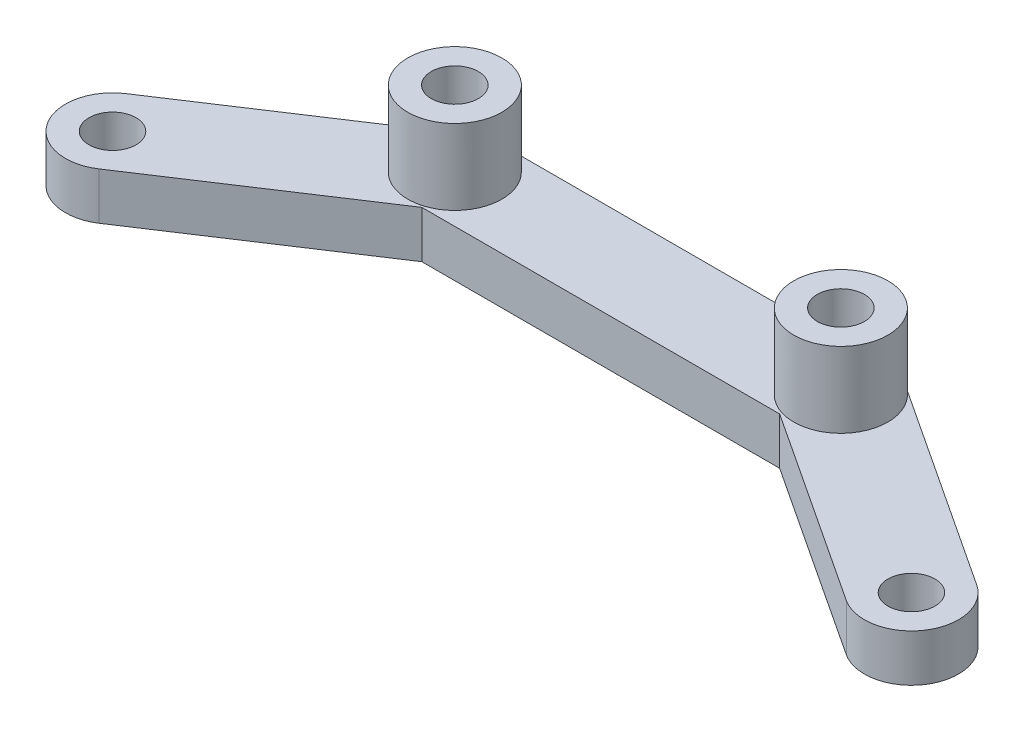
ISO-10303-21;
HEADER;
FILE_DESCRIPTION(('STEP AP214'),'2;1');
FILE_NAME('part.step','',(''),(''),'','','');
FILE_SCHEMA(('AUTOMOTIVE_DESIGN { 1 0 10303 214 1 1 1 1 }'));
ENDSEC;
DATA;
#1=APPLICATION_CONTEXT('core data for automotive mechanical design processes');
#2=APPLICATION_PROTOCOL_DEFINITION('international standard','automotive_design',2000,#1);
#3=PRODUCT_CONTEXT('',#1,'mechanical');
#4=PRODUCT('Part','Part','',(#3));
#5=PRODUCT_RELATED_PRODUCT_CATEGORY('part','',(#4));
#6=PRODUCT_DEFINITION_FORMATION('','',#4);
#7=PRODUCT_DEFINITION_CONTEXT('part definition',#1,'design');
#8=PRODUCT_DEFINITION('design','',#6,#7);
#9=PRODUCT_DEFINITION_SHAPE('','',#8);
#10=(LENGTH_UNIT() NAMED_UNIT(*) SI_UNIT(.MILLI.,.METRE.));
#11=(NAMED_UNIT(*) PLANE_ANGLE_UNIT() SI_UNIT($,.RADIAN.));
#12=(NAMED_UNIT(*) SI_UNIT($,.STERADIAN.) SOLID_ANGLE_UNIT());
#13=UNCERTAINTY_MEASURE_WITH_UNIT(LENGTH_MEASURE(1.E-05),#10,'distance_accuracy_value','');
#14=(GEOMETRIC_REPRESENTATION_CONTEXT(3) GLOBAL_UNCERTAINTY_ASSIGNED_CONTEXT((#13)) GLOBAL_UNIT_ASSIGNED_CONTEXT((#10,
#11,#12)) REPRESENTATION_CONTEXT('',''));
#15=CARTESIAN_POINT('',(0.,0.,0.));
#16=DIRECTION('',(0.,0.,1.));
#17=DIRECTION('',(1.,0.,0.));
#18=AXIS2_PLACEMENT_3D('',#15,#16,#17);
#19=CARTESIAN_POINT('',(-42.4264068711928,5.,42.4264068711929));
#20=DIRECTION('',(0.,-1.,0.));
#21=DIRECTION('',(0.,0.,-1.));
#22=AXIS2_PLACEMENT_3D('',#19,#20,#21);
#23=PLANE('',#22);
#24=CARTESIAN_POINT('',(42.4264068711929,5.,42.4264068711929));
#25=DIRECTION('',(0.,1.,0.));
#26=DIRECTION('',(0.,0.,1.));
#27=AXIS2_PLACEMENT_3D('',#24,#25,#26);
#28=CIRCLE('',#27,2.5);
#29=CARTESIAN_POINT('',(42.4264068711929,5.,44.9264068711929));
#30=VERTEX_POINT('',#29);
#31=EDGE_CURVE('E307',#30,#30,#28,.T.);
#32=ORIENTED_EDGE('',*,*,#31,.F.);
#33=EDGE_LOOP('',(#32));
#34=FACE_BOUND('',#33,.T.);
#35=CARTESIAN_POINT('',(-42.4264068711928,5.,42.4264068711929));
#36=DIRECTION('',(0.,1.,0.));
#37=DIRECTION('',(0.,0.,1.));
#38=AXIS2_PLACEMENT_3D('',#35,#36,#37);
#39=CIRCLE('',#38,2.5);
#40=CARTESIAN_POINT('',(-42.4264068711928,5.,44.9264068711929));
#41=VERTEX_POINT('',#40);
#42=EDGE_CURVE('E273',#41,#41,#39,.T.);
#43=ORIENTED_EDGE('',*,*,#42,.F.);
#44=EDGE_LOOP('',(#43));
#45=FACE_BOUND('',#44,.T.);
#46=CARTESIAN_POINT('',(20.5,5.,28.));
#47=DIRECTION('',(0.,1.,0.));
#48=DIRECTION('',(0.,0.,1.));
#49=AXIS2_PLACEMENT_3D('',#46,#47,#48);
#50=CIRCLE('',#49,5.);
#51=CARTESIAN_POINT('',(20.5,5.,23.));
#52=VERTEX_POINT('',#51);
#53=CARTESIAN_POINT('',(23.2482339660976,5.,23.823014236607));
#54=VERTEX_POINT('',#53);
#55=EDGE_CURVE('E127',#52,#54,#50,.T.);
#56=ORIENTED_EDGE('',*,*,#55,.F.);
#57=DIRECTION('',(-1.,0.,0.));
#58=VECTOR('',#57,1.);
#59=CARTESIAN_POINT('',(-21.9973511112223,5.,23.));
#60=LINE('',#59,#58);
#61=CARTESIAN_POINT('',(-20.5,5.,23.));
#62=VERTEX_POINT('',#61);
#63=EDGE_CURVE('E113',#52,#62,#60,.T.);
#64=ORIENTED_EDGE('',*,*,#63,.T.);
#65=CARTESIAN_POINT('',(-20.5,5.,28.));
#66=DIRECTION('',(0.,1.,0.));
#67=DIRECTION('',(0.,0.,1.));
#68=AXIS2_PLACEMENT_3D('',#65,#66,#67);
#69=CIRCLE('',#68,5.);
#70=CARTESIAN_POINT('',(-23.2482339660976,5.,23.823014236607));
#71=VERTEX_POINT('',#70);
#72=EDGE_CURVE('E142',#71,#62,#69,.T.);
#73=ORIENTED_EDGE('',*,*,#72,.F.);
#74=DIRECTION('',(-0.835397152678596,0.,0.549646793219513));
#75=VECTOR('',#74,1.);
#76=CARTESIAN_POINT('',(-45.1746408372904,5.,38.2494211077999));
#77=LINE('',#76,#75);
#78=CARTESIAN_POINT('',(-45.1746408372904,5.,38.2494211077999));
#79=VERTEX_POINT('',#78);
#80=EDGE_CURVE('E122',#71,#79,#77,.T.);
#81=ORIENTED_EDGE('',*,*,#80,.T.);
#82=CARTESIAN_POINT('',(-42.4264068711928,5.,42.4264068711929));
#83=DIRECTION('',(0.,1.,0.));
#84=DIRECTION('',(0.,0.,-1.));
#85=AXIS2_PLACEMENT_3D('',#82,#83,#84);
#86=CIRCLE('',#85,5.);
#87=CARTESIAN_POINT('',(-39.6781729050953,5.,46.6033926345858));
#88=VERTEX_POINT('',#87);
#89=EDGE_CURVE('E163',#79,#88,#86,.T.);
#90=ORIENTED_EDGE('',*,*,#89,.T.);
#91=DIRECTION('',(0.835397152678596,0.,-0.549646793219513));
#92=VECTOR('',#91,1.);
#93=CARTESIAN_POINT('',(-39.6781729050953,5.,46.6033926345858));
#94=LINE('',#93,#92);
#95=CARTESIAN_POINT('',(-19.0026488887777,5.,33.));
#96=VERTEX_POINT('',#95);
#97=EDGE_CURVE('E295',#88,#96,#94,.T.);
#98=ORIENTED_EDGE('',*,*,#97,.T.);
#99=DIRECTION('',(1.,0.,0.));
#100=VECTOR('',#99,1.);
#101=CARTESIAN_POINT('',(-19.0026488887777,5.,33.));
#102=LINE('',#101,#100);
#103=CARTESIAN_POINT('',(19.0026488887777,5.,33.));
#104=VERTEX_POINT('',#103);
#105=EDGE_CURVE('E291',#96,#104,#102,.T.);
#106=ORIENTED_EDGE('',*,*,#105,.T.);
#107=DIRECTION('',(0.835397152678596,0.,0.549646793219513));
#108=VECTOR('',#107,1.);
#109=CARTESIAN_POINT('',(19.0026488887777,5.,33.));
#110=LINE('',#109,#108);
#111=CARTESIAN_POINT('',(39.6781729050953,5.,46.6033926345858));
#112=VERTEX_POINT('',#111);
#113=EDGE_CURVE('E288',#104,#112,#110,.T.);
#114=ORIENTED_EDGE('',*,*,#113,.T.);
#115=CARTESIAN_POINT('',(42.4264068711929,5.,42.4264068711929));
#116=DIRECTION('',(0.,1.,0.));
#117=DIRECTION('',(0.,0.,1.));
#118=AXIS2_PLACEMENT_3D('',#115,#116,#117);
#119=CIRCLE('',#118,5.);
#120=CARTESIAN_POINT('',(45.1746408372904,5.,38.2494211077999));
#121=VERTEX_POINT('',#120);
#122=EDGE_CURVE('E287',#112,#121,#119,.T.);
#123=ORIENTED_EDGE('',*,*,#122,.T.);
#124=DIRECTION('',(-0.835397152678596,0.,-0.549646793219513));
#125=VECTOR('',#124,1.);
#126=CARTESIAN_POINT('',(21.9973511112223,5.,23.));
#127=LINE('',#126,#125);
#128=EDGE_CURVE('E123',#121,#54,#127,.T.);
#129=ORIENTED_EDGE('',*,*,#128,.T.);
#130=EDGE_LOOP('',(#56,#64,#73,#81,#90,#98,#106,#114,#123,#129));
#131=FACE_BOUND('',#130,.T.);
#132=ADVANCED_FACE('F35',(#34,#45,#131),#23,.F.);
#133=CARTESIAN_POINT('',(-42.4264068711928,0.,42.4264068711929));
#134=DIRECTION('',(0.,-1.,0.));
#135=DIRECTION('',(0.,0.,-1.));
#136=AXIS2_PLACEMENT_3D('',#133,#134,#135);
#137=PLANE('',#136);
#138=CARTESIAN_POINT('',(20.5,0.,28.));
#139=DIRECTION('',(0.,1.,0.));
#140=DIRECTION('',(0.,0.,1.));
#141=AXIS2_PLACEMENT_3D('',#138,#139,#140);
#142=CIRCLE('',#141,2.5);
#143=CARTESIAN_POINT('',(20.5,0.,30.5));
#144=VERTEX_POINT('',#143);
#145=EDGE_CURVE('E304',#144,#144,#142,.T.);
#146=ORIENTED_EDGE('',*,*,#145,.T.);
#147=EDGE_LOOP('',(#146));
#148=FACE_BOUND('',#147,.T.);
#149=CARTESIAN_POINT('',(-42.4264068711928,0.,42.4264068711929));
#150=DIRECTION('',(0.,1.,0.));
#151=DIRECTION('',(0.,0.,1.));
#152=AXIS2_PLACEMENT_3D('',#149,#150,#151);
#153=CIRCLE('',#152,2.5);
#154=CARTESIAN_POINT('',(-42.4264068711928,0.,44.9264068711929));
#155=VERTEX_POINT('',#154);
#156=EDGE_CURVE('E278',#155,#155,#153,.T.);
#157=ORIENTED_EDGE('',*,*,#156,.T.);
#158=EDGE_LOOP('',(#157));
#159=FACE_BOUND('',#158,.T.);
#160=DIRECTION('',(-1.,0.,0.));
#161=VECTOR('',#160,1.);
#162=CARTESIAN_POINT('',(-21.9973511112223,0.,23.));
#163=LINE('',#162,#161);
#164=CARTESIAN_POINT('',(20.5,0.,23.));
#165=VERTEX_POINT('',#164);
#166=CARTESIAN_POINT('',(-20.5,0.,23.));
#167=VERTEX_POINT('',#166);
#168=EDGE_CURVE('E153',#165,#167,#163,.T.);
#169=ORIENTED_EDGE('',*,*,#168,.F.);
#170=CARTESIAN_POINT('',(20.5,0.,28.));
#171=DIRECTION('',(0.,-1.,0.));
#172=DIRECTION('',(0.,0.,-1.));
#173=AXIS2_PLACEMENT_3D('',#170,#171,#172);
#174=CIRCLE('',#173,5.);
#175=CARTESIAN_POINT('',(23.2482339660976,0.,23.823014236607));
#176=VERTEX_POINT('',#175);
#177=EDGE_CURVE('E50',#165,#176,#174,.T.);
#178=ORIENTED_EDGE('',*,*,#177,.T.);
#179=DIRECTION('',(-0.835397152678596,0.,-0.549646793219513));
#180=VECTOR('',#179,1.);
#181=CARTESIAN_POINT('',(21.9973511112223,0.,23.));
#182=LINE('',#181,#180);
#183=CARTESIAN_POINT('',(45.1746408372904,0.,38.2494211077999));
#184=VERTEX_POINT('',#183);
#185=EDGE_CURVE('E149',#184,#176,#182,.T.);
#186=ORIENTED_EDGE('',*,*,#185,.F.);
#187=CARTESIAN_POINT('',(42.4264068711929,0.,42.4264068711929));
#188=DIRECTION('',(0.,1.,0.));
#189=DIRECTION('',(0.,0.,1.));
#190=AXIS2_PLACEMENT_3D('',#187,#188,#189);
#191=CIRCLE('',#190,5.);
#192=CARTESIAN_POINT('',(39.6781729050953,0.,46.6033926345858));
#193=VERTEX_POINT('',#192);
#194=EDGE_CURVE('E154',#193,#184,#191,.T.);
#195=ORIENTED_EDGE('',*,*,#194,.F.);
#196=DIRECTION('',(0.835397152678596,0.,0.549646793219513));
#197=VECTOR('',#196,1.);
#198=CARTESIAN_POINT('',(19.0026488887777,0.,33.));
#199=LINE('',#198,#197);
#200=CARTESIAN_POINT('',(19.0026488887777,0.,33.));
#201=VERTEX_POINT('',#200);
#202=EDGE_CURVE('E158',#201,#193,#199,.T.);
#203=ORIENTED_EDGE('',*,*,#202,.F.);
#204=DIRECTION('',(1.,0.,0.));
#205=VECTOR('',#204,1.);
#206=CARTESIAN_POINT('',(-19.0026488887777,0.,33.));
#207=LINE('',#206,#205);
#208=CARTESIAN_POINT('',(-19.0026488887777,0.,33.));
#209=VERTEX_POINT('',#208);
#210=EDGE_CURVE('E275',#209,#201,#207,.T.);
#211=ORIENTED_EDGE('',*,*,#210,.F.);
#212=DIRECTION('',(0.835397152678596,0.,-0.549646793219513));
#213=VECTOR('',#212,1.);
#214=CARTESIAN_POINT('',(-39.6781729050953,0.,46.6033926345858));
#215=LINE('',#214,#213);
#216=CARTESIAN_POINT('',(-39.6781729050953,0.,46.6033926345858));
#217=VERTEX_POINT('',#216);
#218=EDGE_CURVE('E272',#217,#209,#215,.T.);
#219=ORIENTED_EDGE('',*,*,#218,.F.);
#220=CARTESIAN_POINT('',(-42.4264068711928,0.,42.4264068711929));
#221=DIRECTION('',(0.,1.,0.));
#222=DIRECTION('',(0.,0.,-1.));
#223=AXIS2_PLACEMENT_3D('',#220,#221,#222);
#224=CIRCLE('',#223,5.);
#225=CARTESIAN_POINT('',(-45.1746408372904,0.,38.2494211077999));
#226=VERTEX_POINT('',#225);
#227=EDGE_CURVE('E270',#226,#217,#224,.T.);
#228=ORIENTED_EDGE('',*,*,#227,.F.);
#229=DIRECTION('',(-0.835397152678596,0.,0.549646793219513));
#230=VECTOR('',#229,1.);
#231=CARTESIAN_POINT('',(-45.1746408372904,0.,38.2494211077999));
#232=LINE('',#231,#230);
#233=CARTESIAN_POINT('',(-23.2482339660976,0.,23.823014236607));
#234=VERTEX_POINT('',#233);
#235=EDGE_CURVE('E156',#234,#226,#232,.T.);
#236=ORIENTED_EDGE('',*,*,#235,.F.);
#237=CARTESIAN_POINT('',(-20.5,0.,28.));
#238=DIRECTION('',(0.,-1.,0.));
#239=DIRECTION('',(0.,0.,-1.));
#240=AXIS2_PLACEMENT_3D('',#237,#238,#239);
#241=CIRCLE('',#240,5.);
#242=EDGE_CURVE('E58',#234,#167,#241,.T.);
#243=ORIENTED_EDGE('',*,*,#242,.T.);
#244=EDGE_LOOP('',(#169,#178,#186,#195,#203,#211,#219,#228,#236,#243));
#245=FACE_BOUND('',#244,.T.);
#246=CARTESIAN_POINT('',(-20.5,0.,28.));
#247=DIRECTION('',(0.,1.,0.));
#248=DIRECTION('',(0.,0.,1.));
#249=AXIS2_PLACEMENT_3D('',#246,#247,#248);
#250=CIRCLE('',#249,2.5);
#251=CARTESIAN_POINT('',(-20.5,0.,30.5));
#252=VERTEX_POINT('',#251);
#253=EDGE_CURVE('E300',#252,#252,#250,.T.);
#254=ORIENTED_EDGE('',*,*,#253,.T.);
#255=EDGE_LOOP('',(#254));
#256=FACE_BOUND('',#255,.T.);
#257=CARTESIAN_POINT('',(42.4264068711929,0.,42.4264068711929));
#258=DIRECTION('',(0.,1.,0.));
#259=DIRECTION('',(0.,0.,1.));
#260=AXIS2_PLACEMENT_3D('',#257,#258,#259);
#261=CIRCLE('',#260,2.5);
#262=CARTESIAN_POINT('',(42.4264068711929,0.,44.9264068711929));
#263=VERTEX_POINT('',#262);
#264=EDGE_CURVE('E191',#263,#263,#261,.T.);
#265=ORIENTED_EDGE('',*,*,#264,.T.);
#266=EDGE_LOOP('',(#265));
#267=FACE_BOUND('',#266,.T.);
#268=ADVANCED_FACE('F219',(#148,#159,#245,#256,#267),#137,.T.);
#269=CARTESIAN_POINT('',(-42.4264068711928,5.,42.4264068711929));
#270=DIRECTION('',(0.,-1.,0.));
#271=DIRECTION('',(0.,0.,-1.));
#272=AXIS2_PLACEMENT_3D('',#269,#270,#271);
#273=CYLINDRICAL_SURFACE('',#272,5.);
#274=ORIENTED_EDGE('',*,*,#227,.T.);
#275=DIRECTION('',(0.,-1.,0.));
#276=VECTOR('',#275,1.);
#277=CARTESIAN_POINT('',(-39.6781729050953,5.,46.6033926345858));
#278=LINE('',#277,#276);
#279=EDGE_CURVE('E176',#88,#217,#278,.T.);
#280=ORIENTED_EDGE('',*,*,#279,.F.);
#281=ORIENTED_EDGE('',*,*,#89,.F.);
#282=DIRECTION('',(0.,-1.,0.));
#283=VECTOR('',#282,1.);
#284=CARTESIAN_POINT('',(-45.1746408372904,5.,38.2494211077999));
#285=LINE('',#284,#283);
#286=EDGE_CURVE('E164',#79,#226,#285,.T.);
#287=ORIENTED_EDGE('',*,*,#286,.T.);
#288=EDGE_LOOP('',(#274,#280,#281,#287));
#289=FACE_BOUND('',#288,.T.);
#290=ADVANCED_FACE('F225',(#289),#273,.T.);
#291=CARTESIAN_POINT('',(-39.6781729050953,5.,46.6033926345858));
#292=DIRECTION('',(-0.549646793219513,0.,-0.835397152678596));
#293=DIRECTION('',(-0.835397152678596,0.,0.549646793219513));
#294=AXIS2_PLACEMENT_3D('',#291,#292,#293);
#295=PLANE('',#294);
#296=ORIENTED_EDGE('',*,*,#218,.T.);
#297=DIRECTION('',(0.,-1.,0.));
#298=VECTOR('',#297,1.);
#299=CARTESIAN_POINT('',(-19.0026488887777,5.,33.));
#300=LINE('',#299,#298);
#301=EDGE_CURVE('E174',#96,#209,#300,.T.);
#302=ORIENTED_EDGE('',*,*,#301,.F.);
#303=ORIENTED_EDGE('',*,*,#97,.F.);
#304=ORIENTED_EDGE('',*,*,#279,.T.);
#305=EDGE_LOOP('',(#296,#302,#303,#304));
#306=FACE_BOUND('',#305,.T.);
#307=ADVANCED_FACE('F253',(#306),#295,.F.);
#308=CARTESIAN_POINT('',(-19.0026488887777,5.,33.));
#309=DIRECTION('',(0.,0.,-1.));
#310=DIRECTION('',(-1.,0.,0.));
#311=AXIS2_PLACEMENT_3D('',#308,#309,#310);
#312=PLANE('',#311);
#313=ORIENTED_EDGE('',*,*,#210,.T.);
#314=DIRECTION('',(0.,-1.,0.));
#315=VECTOR('',#314,1.);
#316=CARTESIAN_POINT('',(19.0026488887777,5.,33.));
#317=LINE('',#316,#315);
#318=EDGE_CURVE('E171',#104,#201,#317,.T.);
#319=ORIENTED_EDGE('',*,*,#318,.F.);
#320=ORIENTED_EDGE('',*,*,#105,.F.);
#321=ORIENTED_EDGE('',*,*,#301,.T.);
#322=EDGE_LOOP('',(#313,#319,#320,#321));
#323=FACE_BOUND('',#322,.T.);
#324=ADVANCED_FACE('F249',(#323),#312,.F.);
#325=CARTESIAN_POINT('',(19.0026488887777,5.,33.));
#326=DIRECTION('',(0.549646793219513,0.,-0.835397152678596));
#327=DIRECTION('',(-0.835397152678596,0.,-0.549646793219513));
#328=AXIS2_PLACEMENT_3D('',#325,#326,#327);
#329=PLANE('',#328);
#330=ORIENTED_EDGE('',*,*,#202,.T.);
#331=DIRECTION('',(0.,-1.,0.));
#332=VECTOR('',#331,1.);
#333=CARTESIAN_POINT('',(39.6781729050953,5.,46.6033926345858));
#334=LINE('',#333,#332);
#335=EDGE_CURVE('E168',#112,#193,#334,.T.);
#336=ORIENTED_EDGE('',*,*,#335,.F.);
#337=ORIENTED_EDGE('',*,*,#113,.F.);
#338=ORIENTED_EDGE('',*,*,#318,.T.);
#339=EDGE_LOOP('',(#330,#336,#337,#338));
#340=FACE_BOUND('',#339,.T.);
#341=ADVANCED_FACE('F245',(#340),#329,.F.);
#342=CARTESIAN_POINT('',(42.4264068711929,5.,42.4264068711929));
#343=DIRECTION('',(0.,-1.,0.));
#344=DIRECTION('',(0.,0.,-1.));
#345=AXIS2_PLACEMENT_3D('',#342,#343,#344);
#346=CYLINDRICAL_SURFACE('',#345,5.);
#347=ORIENTED_EDGE('',*,*,#194,.T.);
#348=DIRECTION('',(0.,-1.,0.));
#349=VECTOR('',#348,1.);
#350=CARTESIAN_POINT('',(45.1746408372904,5.,38.2494211077999));
#351=LINE('',#350,#349);
#352=EDGE_CURVE('E151',#121,#184,#351,.T.);
#353=ORIENTED_EDGE('',*,*,#352,.F.);
#354=ORIENTED_EDGE('',*,*,#122,.F.);
#355=ORIENTED_EDGE('',*,*,#335,.T.);
#356=EDGE_LOOP('',(#347,#353,#354,#355));
#357=FACE_BOUND('',#356,.T.);
#358=ADVANCED_FACE('F242',(#357),#346,.T.);
#359=CARTESIAN_POINT('',(21.9973511112223,5.,23.));
#360=DIRECTION('',(-0.549646793219513,0.,0.835397152678596));
#361=DIRECTION('',(0.835397152678596,0.,0.549646793219513));
#362=AXIS2_PLACEMENT_3D('',#359,#360,#361);
#363=PLANE('',#362);
#364=ORIENTED_EDGE('',*,*,#185,.T.);
#365=DIRECTION('',(0.,-1.,0.));
#366=VECTOR('',#365,1.);
#367=CARTESIAN_POINT('',(23.2482339660976,5.,23.823014236607));
#368=LINE('',#367,#366);
#369=EDGE_CURVE('E43',#176,#54,#368,.F.);
#370=ORIENTED_EDGE('',*,*,#369,.T.);
#371=ORIENTED_EDGE('',*,*,#128,.F.);
#372=ORIENTED_EDGE('',*,*,#352,.T.);
#373=EDGE_LOOP('',(#364,#370,#371,#372));
#374=FACE_BOUND('',#373,.T.);
#375=ADVANCED_FACE('F147',(#374),#363,.F.);
#376=CARTESIAN_POINT('',(-21.9973511112223,5.,23.));
#377=DIRECTION('',(0.,0.,1.));
#378=DIRECTION('',(1.,0.,0.));
#379=AXIS2_PLACEMENT_3D('',#376,#377,#378);
#380=PLANE('',#379);
#381=ORIENTED_EDGE('',*,*,#63,.F.);
#382=DIRECTION('',(0.,-1.,0.));
#383=VECTOR('',#382,1.);
#384=CARTESIAN_POINT('',(20.5,5.,23.));
#385=LINE('',#384,#383);
#386=EDGE_CURVE('E118',#52,#165,#385,.T.);
#387=ORIENTED_EDGE('',*,*,#386,.T.);
#388=ORIENTED_EDGE('',*,*,#168,.T.);
#389=DIRECTION('',(0.,-1.,0.));
#390=VECTOR('',#389,1.);
#391=CARTESIAN_POINT('',(-20.5,5.,23.));
#392=LINE('',#391,#390);
#393=EDGE_CURVE('E119',#167,#62,#392,.F.);
#394=ORIENTED_EDGE('',*,*,#393,.T.);
#395=EDGE_LOOP('',(#381,#387,#388,#394));
#396=FACE_BOUND('',#395,.T.);
#397=ADVANCED_FACE('F115',(#396),#380,.F.);
#398=CARTESIAN_POINT('',(-45.1746408372904,5.,38.2494211077999));
#399=DIRECTION('',(0.549646793219513,0.,0.835397152678596));
#400=DIRECTION('',(0.835397152678596,0.,-0.549646793219513));
#401=AXIS2_PLACEMENT_3D('',#398,#399,#400);
#402=PLANE('',#401);
#403=ORIENTED_EDGE('',*,*,#80,.F.);
#404=DIRECTION('',(0.,-1.,0.));
#405=VECTOR('',#404,1.);
#406=CARTESIAN_POINT('',(-23.2482339660976,5.,23.823014236607));
#407=LINE('',#406,#405);
#408=EDGE_CURVE('E11',#71,#234,#407,.T.);
#409=ORIENTED_EDGE('',*,*,#408,.T.);
#410=ORIENTED_EDGE('',*,*,#235,.T.);
#411=ORIENTED_EDGE('',*,*,#286,.F.);
#412=EDGE_LOOP('',(#403,#409,#410,#411));
#413=FACE_BOUND('',#412,.T.);
#414=ADVANCED_FACE('F234',(#413),#402,.F.);
#415=CARTESIAN_POINT('',(-42.4264068711928,5.,42.4264068711929));
#416=DIRECTION('',(0.,-1.,0.));
#417=DIRECTION('',(0.,0.,-1.));
#418=AXIS2_PLACEMENT_3D('',#415,#416,#417);
#419=CYLINDRICAL_SURFACE('',#418,2.5);
#420=ORIENTED_EDGE('',*,*,#42,.T.);
#421=EDGE_LOOP('',(#420));
#422=FACE_BOUND('',#421,.T.);
#423=ORIENTED_EDGE('',*,*,#156,.F.);
#424=EDGE_LOOP('',(#423));
#425=FACE_BOUND('',#424,.T.);
#426=ADVANCED_FACE('F231',(#422,#425),#419,.F.);
#427=CARTESIAN_POINT('',(-20.5,5.,28.));
#428=DIRECTION('',(0.,-1.,0.));
#429=DIRECTION('',(0.,0.,-1.));
#430=AXIS2_PLACEMENT_3D('',#427,#428,#429);
#431=CYLINDRICAL_SURFACE('',#430,2.5);
#432=ORIENTED_EDGE('',*,*,#253,.F.);
#433=EDGE_LOOP('',(#432));
#434=FACE_BOUND('',#433,.T.);
#435=CARTESIAN_POINT('',(-20.5,13.,28.));
#436=DIRECTION('',(0.,1.,0.));
#437=DIRECTION('',(0.,0.,1.));
#438=AXIS2_PLACEMENT_3D('',#435,#436,#437);
#439=CIRCLE('',#438,2.5);
#440=CARTESIAN_POINT('',(-20.5,13.,30.5));
#441=VERTEX_POINT('',#440);
#442=EDGE_CURVE('E189',#441,#441,#439,.T.);
#443=ORIENTED_EDGE('',*,*,#442,.T.);
#444=EDGE_LOOP('',(#443));
#445=FACE_BOUND('',#444,.T.);
#446=ADVANCED_FACE('F323',(#434,#445),#431,.F.);
#447=CARTESIAN_POINT('',(20.5,5.,28.));
#448=DIRECTION('',(0.,-1.,0.));
#449=DIRECTION('',(0.,0.,-1.));
#450=AXIS2_PLACEMENT_3D('',#447,#448,#449);
#451=CYLINDRICAL_SURFACE('',#450,2.5);
#452=ORIENTED_EDGE('',*,*,#145,.F.);
#453=EDGE_LOOP('',(#452));
#454=FACE_BOUND('',#453,.T.);
#455=CARTESIAN_POINT('',(20.5,13.,28.));
#456=DIRECTION('',(0.,1.,0.));
#457=DIRECTION('',(0.,0.,1.));
#458=AXIS2_PLACEMENT_3D('',#455,#456,#457);
#459=CIRCLE('',#458,2.5);
#460=CARTESIAN_POINT('',(20.5,13.,30.5));
#461=VERTEX_POINT('',#460);
#462=EDGE_CURVE('E133',#461,#461,#459,.T.);
#463=ORIENTED_EDGE('',*,*,#462,.T.);
#464=EDGE_LOOP('',(#463));
#465=FACE_BOUND('',#464,.T.);
#466=ADVANCED_FACE('F202',(#454,#465),#451,.F.);
#467=CARTESIAN_POINT('',(42.4264068711929,5.,42.4264068711929));
#468=DIRECTION('',(0.,-1.,0.));
#469=DIRECTION('',(0.,0.,-1.));
#470=AXIS2_PLACEMENT_3D('',#467,#468,#469);
#471=CYLINDRICAL_SURFACE('',#470,2.5);
#472=ORIENTED_EDGE('',*,*,#31,.T.);
#473=EDGE_LOOP('',(#472));
#474=FACE_BOUND('',#473,.T.);
#475=ORIENTED_EDGE('',*,*,#264,.F.);
#476=EDGE_LOOP('',(#475));
#477=FACE_BOUND('',#476,.T.);
#478=ADVANCED_FACE('F311',(#474,#477),#471,.F.);
#479=CARTESIAN_POINT('',(-20.5,13.,28.));
#480=DIRECTION('',(0.,1.,0.));
#481=DIRECTION('',(0.,0.,1.));
#482=AXIS2_PLACEMENT_3D('',#479,#480,#481);
#483=PLANE('',#482);
#484=CARTESIAN_POINT('',(-20.5,13.,28.));
#485=DIRECTION('',(0.,1.,0.));
#486=DIRECTION('',(0.,0.,1.));
#487=AXIS2_PLACEMENT_3D('',#484,#485,#486);
#488=CIRCLE('',#487,5.);
#489=CARTESIAN_POINT('',(-20.5,13.,33.));
#490=VERTEX_POINT('',#489);
#491=EDGE_CURVE('E188',#490,#490,#488,.T.);
#492=ORIENTED_EDGE('',*,*,#491,.T.);
#493=EDGE_LOOP('',(#492));
#494=FACE_BOUND('',#493,.T.);
#495=ORIENTED_EDGE('',*,*,#442,.F.);
#496=EDGE_LOOP('',(#495));
#497=FACE_BOUND('',#496,.T.);
#498=ADVANCED_FACE('F215',(#494,#497),#483,.T.);
#499=CARTESIAN_POINT('',(-20.5,13.,28.));
#500=DIRECTION('',(0.,-1.,0.));
#501=DIRECTION('',(0.,0.,-1.));
#502=AXIS2_PLACEMENT_3D('',#499,#500,#501);
#503=CYLINDRICAL_SURFACE('',#502,5.);
#504=ORIENTED_EDGE('',*,*,#491,.F.);
#505=EDGE_LOOP('',(#504));
#506=FACE_BOUND('',#505,.T.);
#507=EDGE_CURVE('E182',#62,#71,#69,.T.);
#508=ORIENTED_EDGE('',*,*,#507,.T.);
#509=ORIENTED_EDGE('',*,*,#72,.T.);
#510=EDGE_LOOP('',(#508,#509));
#511=FACE_BOUND('',#510,.T.);
#512=ADVANCED_FACE('F206',(#506,#511),#503,.T.);
#513=CARTESIAN_POINT('',(20.5,13.,28.));
#514=DIRECTION('',(0.,1.,0.));
#515=DIRECTION('',(0.,0.,1.));
#516=AXIS2_PLACEMENT_3D('',#513,#514,#515);
#517=PLANE('',#516);
#518=CARTESIAN_POINT('',(20.5,13.,28.));
#519=DIRECTION('',(0.,1.,0.));
#520=DIRECTION('',(0.,0.,1.));
#521=AXIS2_PLACEMENT_3D('',#518,#519,#520);
#522=CIRCLE('',#521,5.);
#523=CARTESIAN_POINT('',(20.5,13.,33.));
#524=VERTEX_POINT('',#523);
#525=EDGE_CURVE('E138',#524,#524,#522,.T.);
#526=ORIENTED_EDGE('',*,*,#525,.T.);
#527=EDGE_LOOP('',(#526));
#528=FACE_BOUND('',#527,.T.);
#529=ORIENTED_EDGE('',*,*,#462,.F.);
#530=EDGE_LOOP('',(#529));
#531=FACE_BOUND('',#530,.T.);
#532=ADVANCED_FACE('F204',(#528,#531),#517,.T.);
#533=CARTESIAN_POINT('',(20.5,13.,28.));
#534=DIRECTION('',(0.,-1.,0.));
#535=DIRECTION('',(0.,0.,-1.));
#536=AXIS2_PLACEMENT_3D('',#533,#534,#535);
#537=CYLINDRICAL_SURFACE('',#536,5.);
#538=ORIENTED_EDGE('',*,*,#525,.F.);
#539=EDGE_LOOP('',(#538));
#540=FACE_BOUND('',#539,.T.);
#541=EDGE_CURVE('E132',#54,#52,#50,.T.);
#542=ORIENTED_EDGE('',*,*,#541,.T.);
#543=ORIENTED_EDGE('',*,*,#55,.T.);
#544=EDGE_LOOP('',(#542,#543));
#545=FACE_BOUND('',#544,.T.);
#546=ADVANCED_FACE('F135',(#540,#545),#537,.T.);
#547=CARTESIAN_POINT('',(20.5,5.,28.));
#548=DIRECTION('',(0.,-1.,0.));
#549=DIRECTION('',(0.,0.,-1.));
#550=AXIS2_PLACEMENT_3D('',#547,#548,#549);
#551=CYLINDRICAL_SURFACE('',#550,5.);
#552=ORIENTED_EDGE('',*,*,#541,.F.);
#553=ORIENTED_EDGE('',*,*,#369,.F.);
#554=ORIENTED_EDGE('',*,*,#177,.F.);
#555=ORIENTED_EDGE('',*,*,#386,.F.);
#556=EDGE_LOOP('',(#552,#553,#554,#555));
#557=FACE_BOUND('',#556,.T.);
#558=ADVANCED_FACE('F139',(#557),#551,.T.);
#559=CARTESIAN_POINT('',(-20.5,5.,28.));
#560=DIRECTION('',(0.,-1.,0.));
#561=DIRECTION('',(0.,0.,-1.));
#562=AXIS2_PLACEMENT_3D('',#559,#560,#561);
#563=CYLINDRICAL_SURFACE('',#562,5.);
#564=ORIENTED_EDGE('',*,*,#507,.F.);
#565=ORIENTED_EDGE('',*,*,#393,.F.);
#566=ORIENTED_EDGE('',*,*,#242,.F.);
#567=ORIENTED_EDGE('',*,*,#408,.F.);
#568=EDGE_LOOP('',(#564,#565,#566,#567));
#569=FACE_BOUND('',#568,.T.);
#570=ADVANCED_FACE('F37',(#569),#563,.T.);
#571=CLOSED_SHELL('',(#132,#268,#290,#307,#324,#341,#358,#375,#397,#414,#426,#446,#466,#478,
#498,#512,#532,#546,#558,#570));
#572=MANIFOLD_SOLID_BREP('B2',#571);
#573=ADVANCED_BREP_SHAPE_REPRESENTATION('',(#18,#572),#14);
#574=SHAPE_DEFINITION_REPRESENTATION(#9,#573);
ENDSEC;
END-ISO-10303-21;
